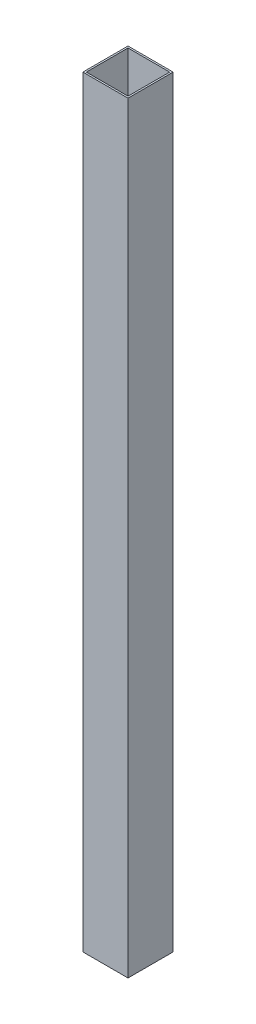
ISO-10303-21;
HEADER;
FILE_DESCRIPTION(('STEP AP214'),'2;1');
FILE_NAME('part.step','',(''),(''),'','','');
FILE_SCHEMA(('AUTOMOTIVE_DESIGN { 1 0 10303 214 1 1 1 1 }'));
ENDSEC;
DATA;
#1=APPLICATION_CONTEXT('core data for automotive mechanical design processes');
#2=APPLICATION_PROTOCOL_DEFINITION('international standard','automotive_design',2000,#1);
#3=PRODUCT_CONTEXT('',#1,'mechanical');
#4=PRODUCT('Part','Part','',(#3));
#5=PRODUCT_RELATED_PRODUCT_CATEGORY('part','',(#4));
#6=PRODUCT_DEFINITION_FORMATION('','',#4);
#7=PRODUCT_DEFINITION_CONTEXT('part definition',#1,'design');
#8=PRODUCT_DEFINITION('design','',#6,#7);
#9=PRODUCT_DEFINITION_SHAPE('','',#8);
#10=(LENGTH_UNIT() NAMED_UNIT(*) SI_UNIT(.MILLI.,.METRE.));
#11=(NAMED_UNIT(*) PLANE_ANGLE_UNIT() SI_UNIT($,.RADIAN.));
#12=(NAMED_UNIT(*) SI_UNIT($,.STERADIAN.) SOLID_ANGLE_UNIT());
#13=UNCERTAINTY_MEASURE_WITH_UNIT(LENGTH_MEASURE(1.E-05),#10,'distance_accuracy_value','');
#14=(GEOMETRIC_REPRESENTATION_CONTEXT(3) GLOBAL_UNCERTAINTY_ASSIGNED_CONTEXT((#13)) GLOBAL_UNIT_ASSIGNED_CONTEXT((#10,
#11,#12)) REPRESENTATION_CONTEXT('',''));
#15=CARTESIAN_POINT('',(0.,0.,0.));
#16=DIRECTION('',(0.,0.,1.));
#17=DIRECTION('',(1.,0.,0.));
#18=AXIS2_PLACEMENT_3D('',#15,#16,#17);
#19=CARTESIAN_POINT('',(0.,428.625,0.));
#20=DIRECTION('',(0.,1.,0.));
#21=DIRECTION('',(0.,0.,1.));
#22=AXIS2_PLACEMENT_3D('',#19,#20,#21);
#23=PLANE('',#22);
#24=DIRECTION('',(0.,0.,-1.));
#25=VECTOR('',#24,1.);
#26=CARTESIAN_POINT('',(12.7,428.625,-12.7));
#27=LINE('',#26,#25);
#28=CARTESIAN_POINT('',(12.7,428.625,12.7));
#29=VERTEX_POINT('',#28);
#30=CARTESIAN_POINT('',(12.7,428.625,-12.7));
#31=VERTEX_POINT('',#30);
#32=EDGE_CURVE('E136',#29,#31,#27,.T.);
#33=ORIENTED_EDGE('',*,*,#32,.T.);
#34=DIRECTION('',(-1.,0.,0.));
#35=VECTOR('',#34,1.);
#36=CARTESIAN_POINT('',(-12.7,428.625,-12.7));
#37=LINE('',#36,#35);
#38=CARTESIAN_POINT('',(-12.7,428.625,-12.7));
#39=VERTEX_POINT('',#38);
#40=EDGE_CURVE('E139',#31,#39,#37,.T.);
#41=ORIENTED_EDGE('',*,*,#40,.T.);
#42=DIRECTION('',(0.,0.,1.));
#43=VECTOR('',#42,1.);
#44=CARTESIAN_POINT('',(-12.7,428.625,-12.7));
#45=LINE('',#44,#43);
#46=CARTESIAN_POINT('',(-12.7,428.625,12.7));
#47=VERTEX_POINT('',#46);
#48=EDGE_CURVE('E142',#39,#47,#45,.T.);
#49=ORIENTED_EDGE('',*,*,#48,.T.);
#50=DIRECTION('',(1.,0.,0.));
#51=VECTOR('',#50,1.);
#52=CARTESIAN_POINT('',(-12.7,428.625,12.7));
#53=LINE('',#52,#51);
#54=EDGE_CURVE('E144',#47,#29,#53,.T.);
#55=ORIENTED_EDGE('',*,*,#54,.T.);
#56=EDGE_LOOP('',(#33,#41,#49,#55));
#57=FACE_BOUND('',#56,.T.);
#58=DIRECTION('',(1.,0.,0.));
#59=VECTOR('',#58,1.);
#60=CARTESIAN_POINT('',(-11.7348,428.625,11.7348));
#61=LINE('',#60,#59);
#62=CARTESIAN_POINT('',(-11.7348,428.625,11.7348));
#63=VERTEX_POINT('',#62);
#64=CARTESIAN_POINT('',(11.7348,428.625,11.7348));
#65=VERTEX_POINT('',#64);
#66=EDGE_CURVE('E108',#63,#65,#61,.T.);
#67=ORIENTED_EDGE('',*,*,#66,.F.);
#68=DIRECTION('',(0.,0.,1.));
#69=VECTOR('',#68,1.);
#70=CARTESIAN_POINT('',(-11.7348,428.625,-11.7348));
#71=LINE('',#70,#69);
#72=CARTESIAN_POINT('',(-11.7348,428.625,-11.7348));
#73=VERTEX_POINT('',#72);
#74=EDGE_CURVE('E100',#73,#63,#71,.T.);
#75=ORIENTED_EDGE('',*,*,#74,.F.);
#76=DIRECTION('',(-1.,0.,0.));
#77=VECTOR('',#76,1.);
#78=CARTESIAN_POINT('',(-11.7348,428.625,-11.7348));
#79=LINE('',#78,#77);
#80=CARTESIAN_POINT('',(11.7348,428.625,-11.7348));
#81=VERTEX_POINT('',#80);
#82=EDGE_CURVE('E122',#81,#73,#79,.T.);
#83=ORIENTED_EDGE('',*,*,#82,.F.);
#84=DIRECTION('',(0.,0.,-1.));
#85=VECTOR('',#84,1.);
#86=CARTESIAN_POINT('',(11.7348,428.625,-11.7348));
#87=LINE('',#86,#85);
#88=EDGE_CURVE('E120',#65,#81,#87,.T.);
#89=ORIENTED_EDGE('',*,*,#88,.F.);
#90=EDGE_LOOP('',(#67,#75,#83,#89));
#91=FACE_BOUND('',#90,.T.);
#92=ADVANCED_FACE('F35',(#57,#91),#23,.T.);
#93=CARTESIAN_POINT('',(0.,0.,0.));
#94=DIRECTION('',(0.,1.,0.));
#95=DIRECTION('',(0.,0.,1.));
#96=AXIS2_PLACEMENT_3D('',#93,#94,#95);
#97=PLANE('',#96);
#98=DIRECTION('',(0.,0.,-1.));
#99=VECTOR('',#98,1.);
#100=CARTESIAN_POINT('',(12.7,0.,-12.7));
#101=LINE('',#100,#99);
#102=CARTESIAN_POINT('',(12.7,0.,12.7));
#103=VERTEX_POINT('',#102);
#104=CARTESIAN_POINT('',(12.7,0.,-12.7));
#105=VERTEX_POINT('',#104);
#106=EDGE_CURVE('E116',#103,#105,#101,.T.);
#107=ORIENTED_EDGE('',*,*,#106,.F.);
#108=DIRECTION('',(1.,0.,0.));
#109=VECTOR('',#108,1.);
#110=CARTESIAN_POINT('',(-12.7,0.,12.7));
#111=LINE('',#110,#109);
#112=CARTESIAN_POINT('',(-12.7,0.,12.7));
#113=VERTEX_POINT('',#112);
#114=EDGE_CURVE('E140',#113,#103,#111,.T.);
#115=ORIENTED_EDGE('',*,*,#114,.F.);
#116=DIRECTION('',(0.,0.,1.));
#117=VECTOR('',#116,1.);
#118=CARTESIAN_POINT('',(-12.7,0.,-12.7));
#119=LINE('',#118,#117);
#120=CARTESIAN_POINT('',(-12.7,0.,-12.7));
#121=VERTEX_POINT('',#120);
#122=EDGE_CURVE('E151',#121,#113,#119,.T.);
#123=ORIENTED_EDGE('',*,*,#122,.F.);
#124=DIRECTION('',(-1.,0.,0.));
#125=VECTOR('',#124,1.);
#126=CARTESIAN_POINT('',(-12.7,0.,-12.7));
#127=LINE('',#126,#125);
#128=EDGE_CURVE('E149',#105,#121,#127,.T.);
#129=ORIENTED_EDGE('',*,*,#128,.F.);
#130=EDGE_LOOP('',(#107,#115,#123,#129));
#131=FACE_BOUND('',#130,.T.);
#132=DIRECTION('',(0.,0.,1.));
#133=VECTOR('',#132,1.);
#134=CARTESIAN_POINT('',(-11.7348,0.,-11.7348));
#135=LINE('',#134,#133);
#136=CARTESIAN_POINT('',(-11.7348,0.,-11.7348));
#137=VERTEX_POINT('',#136);
#138=CARTESIAN_POINT('',(-11.7348,0.,11.7348));
#139=VERTEX_POINT('',#138);
#140=EDGE_CURVE('E58',#137,#139,#135,.T.);
#141=ORIENTED_EDGE('',*,*,#140,.T.);
#142=DIRECTION('',(1.,0.,0.));
#143=VECTOR('',#142,1.);
#144=CARTESIAN_POINT('',(-11.7348,0.,11.7348));
#145=LINE('',#144,#143);
#146=CARTESIAN_POINT('',(11.7348,0.,11.7348));
#147=VERTEX_POINT('',#146);
#148=EDGE_CURVE('E115',#139,#147,#145,.T.);
#149=ORIENTED_EDGE('',*,*,#148,.T.);
#150=DIRECTION('',(0.,0.,-1.));
#151=VECTOR('',#150,1.);
#152=CARTESIAN_POINT('',(11.7348,0.,-11.7348));
#153=LINE('',#152,#151);
#154=CARTESIAN_POINT('',(11.7348,0.,-11.7348));
#155=VERTEX_POINT('',#154);
#156=EDGE_CURVE('E128',#147,#155,#153,.T.);
#157=ORIENTED_EDGE('',*,*,#156,.T.);
#158=DIRECTION('',(-1.,0.,0.));
#159=VECTOR('',#158,1.);
#160=CARTESIAN_POINT('',(-11.7348,0.,-11.7348));
#161=LINE('',#160,#159);
#162=EDGE_CURVE('E109',#155,#137,#161,.T.);
#163=ORIENTED_EDGE('',*,*,#162,.T.);
#164=EDGE_LOOP('',(#141,#149,#157,#163));
#165=FACE_BOUND('',#164,.T.);
#166=ADVANCED_FACE('F169',(#131,#165),#97,.F.);
#167=CARTESIAN_POINT('',(12.7,428.625,-12.7));
#168=DIRECTION('',(-1.,0.,0.));
#169=DIRECTION('',(0.,0.,1.));
#170=AXIS2_PLACEMENT_3D('',#167,#168,#169);
#171=PLANE('',#170);
#172=ORIENTED_EDGE('',*,*,#106,.T.);
#173=DIRECTION('',(0.,-1.,0.));
#174=VECTOR('',#173,1.);
#175=CARTESIAN_POINT('',(12.7,428.625,-12.7));
#176=LINE('',#175,#174);
#177=EDGE_CURVE('E11',#31,#105,#176,.T.);
#178=ORIENTED_EDGE('',*,*,#177,.F.);
#179=ORIENTED_EDGE('',*,*,#32,.F.);
#180=DIRECTION('',(0.,-1.,0.));
#181=VECTOR('',#180,1.);
#182=CARTESIAN_POINT('',(12.7,428.625,12.7));
#183=LINE('',#182,#181);
#184=EDGE_CURVE('E146',#29,#103,#183,.T.);
#185=ORIENTED_EDGE('',*,*,#184,.T.);
#186=EDGE_LOOP('',(#172,#178,#179,#185));
#187=FACE_BOUND('',#186,.T.);
#188=ADVANCED_FACE('F37',(#187),#171,.F.);
#189=CARTESIAN_POINT('',(-12.7,428.625,-12.7));
#190=DIRECTION('',(0.,0.,1.));
#191=DIRECTION('',(1.,0.,0.));
#192=AXIS2_PLACEMENT_3D('',#189,#190,#191);
#193=PLANE('',#192);
#194=ORIENTED_EDGE('',*,*,#128,.T.);
#195=DIRECTION('',(0.,-1.,0.));
#196=VECTOR('',#195,1.);
#197=CARTESIAN_POINT('',(-12.7,428.625,-12.7));
#198=LINE('',#197,#196);
#199=EDGE_CURVE('E43',#39,#121,#198,.T.);
#200=ORIENTED_EDGE('',*,*,#199,.F.);
#201=ORIENTED_EDGE('',*,*,#40,.F.);
#202=ORIENTED_EDGE('',*,*,#177,.T.);
#203=EDGE_LOOP('',(#194,#200,#201,#202));
#204=FACE_BOUND('',#203,.T.);
#205=ADVANCED_FACE('F179',(#204),#193,.F.);
#206=CARTESIAN_POINT('',(-12.7,428.625,-12.7));
#207=DIRECTION('',(1.,0.,0.));
#208=DIRECTION('',(0.,0.,-1.));
#209=AXIS2_PLACEMENT_3D('',#206,#207,#208);
#210=PLANE('',#209);
#211=ORIENTED_EDGE('',*,*,#122,.T.);
#212=DIRECTION('',(0.,-1.,0.));
#213=VECTOR('',#212,1.);
#214=CARTESIAN_POINT('',(-12.7,428.625,12.7));
#215=LINE('',#214,#213);
#216=EDGE_CURVE('E156',#47,#113,#215,.T.);
#217=ORIENTED_EDGE('',*,*,#216,.F.);
#218=ORIENTED_EDGE('',*,*,#48,.F.);
#219=ORIENTED_EDGE('',*,*,#199,.T.);
#220=EDGE_LOOP('',(#211,#217,#218,#219));
#221=FACE_BOUND('',#220,.T.);
#222=ADVANCED_FACE('F163',(#221),#210,.F.);
#223=CARTESIAN_POINT('',(-12.7,428.625,12.7));
#224=DIRECTION('',(0.,0.,-1.));
#225=DIRECTION('',(-1.,0.,0.));
#226=AXIS2_PLACEMENT_3D('',#223,#224,#225);
#227=PLANE('',#226);
#228=ORIENTED_EDGE('',*,*,#114,.T.);
#229=ORIENTED_EDGE('',*,*,#184,.F.);
#230=ORIENTED_EDGE('',*,*,#54,.F.);
#231=ORIENTED_EDGE('',*,*,#216,.T.);
#232=EDGE_LOOP('',(#228,#229,#230,#231));
#233=FACE_BOUND('',#232,.T.);
#234=ADVANCED_FACE('F173',(#233),#227,.F.);
#235=CARTESIAN_POINT('',(-11.7348,428.625,-11.7348));
#236=DIRECTION('',(1.,0.,0.));
#237=DIRECTION('',(0.,0.,-1.));
#238=AXIS2_PLACEMENT_3D('',#235,#236,#237);
#239=PLANE('',#238);
#240=ORIENTED_EDGE('',*,*,#140,.F.);
#241=DIRECTION('',(0.,-1.,0.));
#242=VECTOR('',#241,1.);
#243=CARTESIAN_POINT('',(-11.7348,428.625,-11.7348));
#244=LINE('',#243,#242);
#245=EDGE_CURVE('E104',#73,#137,#244,.T.);
#246=ORIENTED_EDGE('',*,*,#245,.F.);
#247=ORIENTED_EDGE('',*,*,#74,.T.);
#248=DIRECTION('',(0.,-1.,0.));
#249=VECTOR('',#248,1.);
#250=CARTESIAN_POINT('',(-11.7348,428.625,11.7348));
#251=LINE('',#250,#249);
#252=EDGE_CURVE('E103',#63,#139,#251,.T.);
#253=ORIENTED_EDGE('',*,*,#252,.T.);
#254=EDGE_LOOP('',(#240,#246,#247,#253));
#255=FACE_BOUND('',#254,.T.);
#256=ADVANCED_FACE('F102',(#255),#239,.T.);
#257=CARTESIAN_POINT('',(-11.7348,428.625,11.7348));
#258=DIRECTION('',(0.,0.,-1.));
#259=DIRECTION('',(-1.,0.,0.));
#260=AXIS2_PLACEMENT_3D('',#257,#258,#259);
#261=PLANE('',#260);
#262=ORIENTED_EDGE('',*,*,#148,.F.);
#263=ORIENTED_EDGE('',*,*,#252,.F.);
#264=ORIENTED_EDGE('',*,*,#66,.T.);
#265=DIRECTION('',(0.,-1.,0.));
#266=VECTOR('',#265,1.);
#267=CARTESIAN_POINT('',(11.7348,428.625,11.7348));
#268=LINE('',#267,#266);
#269=EDGE_CURVE('E117',#65,#147,#268,.T.);
#270=ORIENTED_EDGE('',*,*,#269,.T.);
#271=EDGE_LOOP('',(#262,#263,#264,#270));
#272=FACE_BOUND('',#271,.T.);
#273=ADVANCED_FACE('F112',(#272),#261,.T.);
#274=CARTESIAN_POINT('',(11.7348,428.625,-11.7348));
#275=DIRECTION('',(-1.,0.,0.));
#276=DIRECTION('',(0.,0.,1.));
#277=AXIS2_PLACEMENT_3D('',#274,#275,#276);
#278=PLANE('',#277);
#279=ORIENTED_EDGE('',*,*,#156,.F.);
#280=ORIENTED_EDGE('',*,*,#269,.F.);
#281=ORIENTED_EDGE('',*,*,#88,.T.);
#282=DIRECTION('',(0.,-1.,0.));
#283=VECTOR('',#282,1.);
#284=CARTESIAN_POINT('',(11.7348,428.625,-11.7348));
#285=LINE('',#284,#283);
#286=EDGE_CURVE('E50',#81,#155,#285,.T.);
#287=ORIENTED_EDGE('',*,*,#286,.T.);
#288=EDGE_LOOP('',(#279,#280,#281,#287));
#289=FACE_BOUND('',#288,.T.);
#290=ADVANCED_FACE('F202',(#289),#278,.T.);
#291=CARTESIAN_POINT('',(-11.7348,428.625,-11.7348));
#292=DIRECTION('',(0.,0.,1.));
#293=DIRECTION('',(1.,0.,0.));
#294=AXIS2_PLACEMENT_3D('',#291,#292,#293);
#295=PLANE('',#294);
#296=ORIENTED_EDGE('',*,*,#162,.F.);
#297=ORIENTED_EDGE('',*,*,#286,.F.);
#298=ORIENTED_EDGE('',*,*,#82,.T.);
#299=ORIENTED_EDGE('',*,*,#245,.T.);
#300=EDGE_LOOP('',(#296,#297,#298,#299));
#301=FACE_BOUND('',#300,.T.);
#302=ADVANCED_FACE('F206',(#301),#295,.T.);
#303=CLOSED_SHELL('',(#92,#166,#188,#205,#222,#234,#256,#273,#290,#302));
#304=MANIFOLD_SOLID_BREP('B2',#303);
#305=ADVANCED_BREP_SHAPE_REPRESENTATION('',(#18,#304),#14);
#306=SHAPE_DEFINITION_REPRESENTATION(#9,#305);
ENDSEC;
END-ISO-10303-21;
